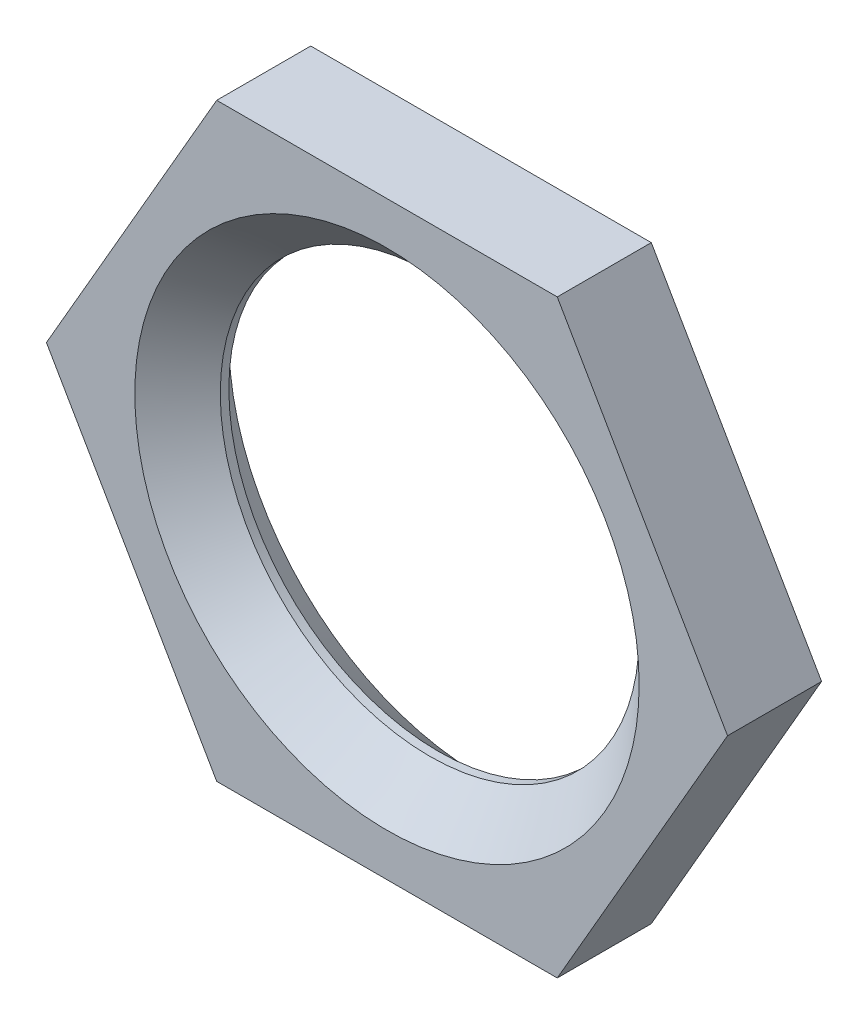
ISO-10303-21;
HEADER;
FILE_DESCRIPTION(('STEP AP214'),'2;1');
FILE_NAME('part.step','',(''),(''),'','','');
FILE_SCHEMA(('AUTOMOTIVE_DESIGN { 1 0 10303 214 1 1 1 1 }'));
ENDSEC;
DATA;
#1=APPLICATION_CONTEXT('core data for automotive mechanical design processes');
#2=APPLICATION_PROTOCOL_DEFINITION('international standard','automotive_design',2000,#1);
#3=PRODUCT_CONTEXT('',#1,'mechanical');
#4=PRODUCT('Part','Part','',(#3));
#5=PRODUCT_RELATED_PRODUCT_CATEGORY('part','',(#4));
#6=PRODUCT_DEFINITION_FORMATION('','',#4);
#7=PRODUCT_DEFINITION_CONTEXT('part definition',#1,'design');
#8=PRODUCT_DEFINITION('design','',#6,#7);
#9=PRODUCT_DEFINITION_SHAPE('','',#8);
#10=(LENGTH_UNIT() NAMED_UNIT(*) SI_UNIT(.MILLI.,.METRE.));
#11=(NAMED_UNIT(*) PLANE_ANGLE_UNIT() SI_UNIT($,.RADIAN.));
#12=(NAMED_UNIT(*) SI_UNIT($,.STERADIAN.) SOLID_ANGLE_UNIT());
#13=UNCERTAINTY_MEASURE_WITH_UNIT(LENGTH_MEASURE(1.E-05),#10,'distance_accuracy_value','');
#14=(GEOMETRIC_REPRESENTATION_CONTEXT(3) GLOBAL_UNCERTAINTY_ASSIGNED_CONTEXT((#13)) GLOBAL_UNIT_ASSIGNED_CONTEXT((#10,
#11,#12)) REPRESENTATION_CONTEXT('',''));
#15=CARTESIAN_POINT('',(0.,0.,0.));
#16=DIRECTION('',(0.,0.,1.));
#17=DIRECTION('',(1.,0.,0.));
#18=AXIS2_PLACEMENT_3D('',#15,#16,#17);
#19=CARTESIAN_POINT('',(0.,0.,2.2));
#20=DIRECTION('',(0.,0.,1.));
#21=DIRECTION('',(1.,0.,0.));
#22=AXIS2_PLACEMENT_3D('',#19,#20,#21);
#23=PLANE('',#22);
#24=CARTESIAN_POINT('',(0.,0.,2.2));
#25=DIRECTION('',(0.,0.,1.));
#26=DIRECTION('',(1.,0.,0.));
#27=AXIS2_PLACEMENT_3D('',#24,#25,#26);
#28=CIRCLE('',#27,5.90000000000001);
#29=CARTESIAN_POINT('',(5.90000000000001,0.,2.2));
#30=VERTEX_POINT('',#29);
#31=EDGE_CURVE('E11',#30,#30,#28,.F.);
#32=ORIENTED_EDGE('',*,*,#31,.T.);
#33=EDGE_LOOP('',(#32));
#34=FACE_BOUND('',#33,.T.);
#35=DIRECTION('',(-0.5,0.866025403784439,0.));
#36=VECTOR('',#35,1.);
#37=CARTESIAN_POINT('',(7.96743371481684,0.,2.2));
#38=LINE('',#37,#36);
#39=CARTESIAN_POINT('',(7.96743371481684,0.,2.2));
#40=VERTEX_POINT('',#39);
#41=CARTESIAN_POINT('',(3.98371685740842,6.9,2.2));
#42=VERTEX_POINT('',#41);
#43=EDGE_CURVE('E148',#40,#42,#38,.T.);
#44=ORIENTED_EDGE('',*,*,#43,.T.);
#45=DIRECTION('',(-1.,0.,0.));
#46=VECTOR('',#45,1.);
#47=CARTESIAN_POINT('',(3.98371685740842,6.9,2.2));
#48=LINE('',#47,#46);
#49=CARTESIAN_POINT('',(-3.98371685740842,6.9,2.2));
#50=VERTEX_POINT('',#49);
#51=EDGE_CURVE('E98',#42,#50,#48,.T.);
#52=ORIENTED_EDGE('',*,*,#51,.T.);
#53=DIRECTION('',(-0.5,-0.866025403784439,0.));
#54=VECTOR('',#53,1.);
#55=CARTESIAN_POINT('',(-3.98371685740842,6.9,2.2));
#56=LINE('',#55,#54);
#57=CARTESIAN_POINT('',(-7.96743371481684,0.,2.2));
#58=VERTEX_POINT('',#57);
#59=EDGE_CURVE('E110',#50,#58,#56,.T.);
#60=ORIENTED_EDGE('',*,*,#59,.T.);
#61=DIRECTION('',(0.5,-0.866025403784438,0.));
#62=VECTOR('',#61,1.);
#63=CARTESIAN_POINT('',(-7.96743371481684,0.,2.2));
#64=LINE('',#63,#62);
#65=CARTESIAN_POINT('',(-3.98371685740841,-6.9,2.2));
#66=VERTEX_POINT('',#65);
#67=EDGE_CURVE('E105',#58,#66,#64,.T.);
#68=ORIENTED_EDGE('',*,*,#67,.T.);
#69=DIRECTION('',(1.,0.,0.));
#70=VECTOR('',#69,1.);
#71=CARTESIAN_POINT('',(-3.98371685740841,-6.9,2.2));
#72=LINE('',#71,#70);
#73=CARTESIAN_POINT('',(3.98371685740842,-6.9,2.2));
#74=VERTEX_POINT('',#73);
#75=EDGE_CURVE('E108',#66,#74,#72,.T.);
#76=ORIENTED_EDGE('',*,*,#75,.T.);
#77=DIRECTION('',(0.5,0.866025403784439,0.));
#78=VECTOR('',#77,1.);
#79=CARTESIAN_POINT('',(3.98371685740842,-6.9,2.2));
#80=LINE('',#79,#78);
#81=EDGE_CURVE('E60',#74,#40,#80,.T.);
#82=ORIENTED_EDGE('',*,*,#81,.T.);
#83=EDGE_LOOP('',(#44,#52,#60,#68,#76,#82));
#84=FACE_BOUND('',#83,.T.);
#85=ADVANCED_FACE('F41',(#34,#84),#23,.T.);
#86=CARTESIAN_POINT('',(0.,0.,0.));
#87=DIRECTION('',(0.,0.,1.));
#88=DIRECTION('',(1.,0.,0.));
#89=AXIS2_PLACEMENT_3D('',#86,#87,#88);
#90=PLANE('',#89);
#91=CARTESIAN_POINT('',(0.,0.,0.));
#92=DIRECTION('',(0.,0.,1.));
#93=DIRECTION('',(1.,0.,0.));
#94=AXIS2_PLACEMENT_3D('',#91,#92,#93);
#95=CIRCLE('',#94,5.9);
#96=CARTESIAN_POINT('',(5.9,0.,0.));
#97=VERTEX_POINT('',#96);
#98=EDGE_CURVE('E162',#97,#97,#95,.T.);
#99=ORIENTED_EDGE('',*,*,#98,.T.);
#100=EDGE_LOOP('',(#99));
#101=FACE_BOUND('',#100,.T.);
#102=DIRECTION('',(-0.5,0.866025403784439,0.));
#103=VECTOR('',#102,1.);
#104=CARTESIAN_POINT('',(7.96743371481684,0.,0.));
#105=LINE('',#104,#103);
#106=CARTESIAN_POINT('',(7.96743371481684,0.,0.));
#107=VERTEX_POINT('',#106);
#108=CARTESIAN_POINT('',(3.98371685740842,6.9,0.));
#109=VERTEX_POINT('',#108);
#110=EDGE_CURVE('E132',#107,#109,#105,.T.);
#111=ORIENTED_EDGE('',*,*,#110,.F.);
#112=DIRECTION('',(0.5,0.866025403784439,0.));
#113=VECTOR('',#112,1.);
#114=CARTESIAN_POINT('',(3.98371685740842,-6.9,0.));
#115=LINE('',#114,#113);
#116=CARTESIAN_POINT('',(3.98371685740842,-6.9,0.));
#117=VERTEX_POINT('',#116);
#118=EDGE_CURVE('E89',#117,#107,#115,.T.);
#119=ORIENTED_EDGE('',*,*,#118,.F.);
#120=DIRECTION('',(1.,0.,0.));
#121=VECTOR('',#120,1.);
#122=CARTESIAN_POINT('',(-3.98371685740841,-6.9,0.));
#123=LINE('',#122,#121);
#124=CARTESIAN_POINT('',(-3.98371685740841,-6.9,0.));
#125=VERTEX_POINT('',#124);
#126=EDGE_CURVE('E83',#125,#117,#123,.T.);
#127=ORIENTED_EDGE('',*,*,#126,.F.);
#128=DIRECTION('',(0.5,-0.866025403784438,0.));
#129=VECTOR('',#128,1.);
#130=CARTESIAN_POINT('',(-7.96743371481684,0.,0.));
#131=LINE('',#130,#129);
#132=CARTESIAN_POINT('',(-7.96743371481684,0.,0.));
#133=VERTEX_POINT('',#132);
#134=EDGE_CURVE('E119',#133,#125,#131,.T.);
#135=ORIENTED_EDGE('',*,*,#134,.F.);
#136=DIRECTION('',(-0.5,-0.866025403784439,0.));
#137=VECTOR('',#136,1.);
#138=CARTESIAN_POINT('',(-3.98371685740842,6.9,0.));
#139=LINE('',#138,#137);
#140=CARTESIAN_POINT('',(-3.98371685740842,6.9,0.));
#141=VERTEX_POINT('',#140);
#142=EDGE_CURVE('E139',#141,#133,#139,.T.);
#143=ORIENTED_EDGE('',*,*,#142,.F.);
#144=DIRECTION('',(-1.,0.,0.));
#145=VECTOR('',#144,1.);
#146=CARTESIAN_POINT('',(3.98371685740842,6.9,0.));
#147=LINE('',#146,#145);
#148=EDGE_CURVE('E136',#109,#141,#147,.T.);
#149=ORIENTED_EDGE('',*,*,#148,.F.);
#150=EDGE_LOOP('',(#111,#119,#127,#135,#143,#149));
#151=FACE_BOUND('',#150,.T.);
#152=ADVANCED_FACE('F181',(#101,#151),#90,.F.);
#153=CARTESIAN_POINT('',(7.96743371481684,0.,2.2));
#154=DIRECTION('',(-0.866025403784439,-0.5,0.));
#155=DIRECTION('',(0.5,-0.866025403784439,0.));
#156=AXIS2_PLACEMENT_3D('',#153,#154,#155);
#157=PLANE('',#156);
#158=ORIENTED_EDGE('',*,*,#110,.T.);
#159=DIRECTION('',(0.,0.,-1.));
#160=VECTOR('',#159,1.);
#161=CARTESIAN_POINT('',(3.98371685740842,6.9,2.2));
#162=LINE('',#161,#160);
#163=EDGE_CURVE('E159',#42,#109,#162,.T.);
#164=ORIENTED_EDGE('',*,*,#163,.F.);
#165=ORIENTED_EDGE('',*,*,#43,.F.);
#166=DIRECTION('',(0.,0.,-1.));
#167=VECTOR('',#166,1.);
#168=CARTESIAN_POINT('',(7.96743371481684,0.,2.2));
#169=LINE('',#168,#167);
#170=EDGE_CURVE('E128',#40,#107,#169,.T.);
#171=ORIENTED_EDGE('',*,*,#170,.T.);
#172=EDGE_LOOP('',(#158,#164,#165,#171));
#173=FACE_BOUND('',#172,.T.);
#174=ADVANCED_FACE('F184',(#173),#157,.F.);
#175=CARTESIAN_POINT('',(3.98371685740842,6.9,2.2));
#176=DIRECTION('',(0.,-1.,0.));
#177=DIRECTION('',(0.,0.,-1.));
#178=AXIS2_PLACEMENT_3D('',#175,#176,#177);
#179=PLANE('',#178);
#180=ORIENTED_EDGE('',*,*,#148,.T.);
#181=DIRECTION('',(0.,0.,-1.));
#182=VECTOR('',#181,1.);
#183=CARTESIAN_POINT('',(-3.98371685740842,6.9,2.2));
#184=LINE('',#183,#182);
#185=EDGE_CURVE('E155',#50,#141,#184,.T.);
#186=ORIENTED_EDGE('',*,*,#185,.F.);
#187=ORIENTED_EDGE('',*,*,#51,.F.);
#188=ORIENTED_EDGE('',*,*,#163,.T.);
#189=EDGE_LOOP('',(#180,#186,#187,#188));
#190=FACE_BOUND('',#189,.T.);
#191=ADVANCED_FACE('F260',(#190),#179,.F.);
#192=CARTESIAN_POINT('',(-3.98371685740842,6.9,2.2));
#193=DIRECTION('',(0.866025403784439,-0.5,0.));
#194=DIRECTION('',(0.5,0.866025403784439,0.));
#195=AXIS2_PLACEMENT_3D('',#192,#193,#194);
#196=PLANE('',#195);
#197=ORIENTED_EDGE('',*,*,#142,.T.);
#198=DIRECTION('',(0.,0.,-1.));
#199=VECTOR('',#198,1.);
#200=CARTESIAN_POINT('',(-7.96743371481684,0.,2.2));
#201=LINE('',#200,#199);
#202=EDGE_CURVE('E121',#58,#133,#201,.T.);
#203=ORIENTED_EDGE('',*,*,#202,.F.);
#204=ORIENTED_EDGE('',*,*,#59,.F.);
#205=ORIENTED_EDGE('',*,*,#185,.T.);
#206=EDGE_LOOP('',(#197,#203,#204,#205));
#207=FACE_BOUND('',#206,.T.);
#208=ADVANCED_FACE('F251',(#207),#196,.F.);
#209=CARTESIAN_POINT('',(-7.96743371481684,0.,2.2));
#210=DIRECTION('',(0.866025403784438,0.5,0.));
#211=DIRECTION('',(-0.5,0.866025403784439,0.));
#212=AXIS2_PLACEMENT_3D('',#209,#210,#211);
#213=PLANE('',#212);
#214=ORIENTED_EDGE('',*,*,#134,.T.);
#215=DIRECTION('',(0.,0.,-1.));
#216=VECTOR('',#215,1.);
#217=CARTESIAN_POINT('',(-3.98371685740841,-6.9,2.2));
#218=LINE('',#217,#216);
#219=EDGE_CURVE('E116',#66,#125,#218,.T.);
#220=ORIENTED_EDGE('',*,*,#219,.F.);
#221=ORIENTED_EDGE('',*,*,#67,.F.);
#222=ORIENTED_EDGE('',*,*,#202,.T.);
#223=EDGE_LOOP('',(#214,#220,#221,#222));
#224=FACE_BOUND('',#223,.T.);
#225=ADVANCED_FACE('F117',(#224),#213,.F.);
#226=CARTESIAN_POINT('',(-3.98371685740841,-6.9,2.2));
#227=DIRECTION('',(0.,1.,0.));
#228=DIRECTION('',(-1.,0.,0.));
#229=AXIS2_PLACEMENT_3D('',#226,#227,#228);
#230=PLANE('',#229);
#231=ORIENTED_EDGE('',*,*,#126,.T.);
#232=DIRECTION('',(0.,0.,-1.));
#233=VECTOR('',#232,1.);
#234=CARTESIAN_POINT('',(3.98371685740842,-6.9,2.2));
#235=LINE('',#234,#233);
#236=EDGE_CURVE('E122',#74,#117,#235,.T.);
#237=ORIENTED_EDGE('',*,*,#236,.F.);
#238=ORIENTED_EDGE('',*,*,#75,.F.);
#239=ORIENTED_EDGE('',*,*,#219,.T.);
#240=EDGE_LOOP('',(#231,#237,#238,#239));
#241=FACE_BOUND('',#240,.T.);
#242=ADVANCED_FACE('F124',(#241),#230,.F.);
#243=CARTESIAN_POINT('',(3.98371685740842,-6.9,2.2));
#244=DIRECTION('',(-0.866025403784439,0.5,0.));
#245=DIRECTION('',(-0.5,-0.866025403784439,0.));
#246=AXIS2_PLACEMENT_3D('',#243,#244,#245);
#247=PLANE('',#246);
#248=ORIENTED_EDGE('',*,*,#118,.T.);
#249=ORIENTED_EDGE('',*,*,#170,.F.);
#250=ORIENTED_EDGE('',*,*,#81,.F.);
#251=ORIENTED_EDGE('',*,*,#236,.T.);
#252=EDGE_LOOP('',(#248,#249,#250,#251));
#253=FACE_BOUND('',#252,.T.);
#254=ADVANCED_FACE('F191',(#253),#247,.F.);
#255=CARTESIAN_POINT('',(0.,0.,2.2));
#256=DIRECTION('',(0.,0.,-1.));
#257=DIRECTION('',(-1.,0.,0.));
#258=AXIS2_PLACEMENT_3D('',#255,#256,#257);
#259=CYLINDRICAL_SURFACE('',#258,4.9);
#260=CARTESIAN_POINT('',(0.,0.,1.00000000000001));
#261=DIRECTION('',(0.,0.,1.));
#262=DIRECTION('',(1.,0.,0.));
#263=AXIS2_PLACEMENT_3D('',#260,#261,#262);
#264=CIRCLE('',#263,4.9);
#265=CARTESIAN_POINT('',(4.9,0.,1.00000000000001));
#266=VERTEX_POINT('',#265);
#267=EDGE_CURVE('E52',#266,#266,#264,.F.);
#268=ORIENTED_EDGE('',*,*,#267,.T.);
#269=EDGE_LOOP('',(#268));
#270=FACE_BOUND('',#269,.T.);
#271=CARTESIAN_POINT('',(0.,0.,1.2));
#272=DIRECTION('',(0.,0.,1.));
#273=DIRECTION('',(1.,0.,0.));
#274=AXIS2_PLACEMENT_3D('',#271,#272,#273);
#275=CIRCLE('',#274,4.9);
#276=CARTESIAN_POINT('',(4.9,0.,1.2));
#277=VERTEX_POINT('',#276);
#278=EDGE_CURVE('E166',#277,#277,#275,.T.);
#279=ORIENTED_EDGE('',*,*,#278,.T.);
#280=EDGE_LOOP('',(#279));
#281=FACE_BOUND('',#280,.T.);
#282=ADVANCED_FACE('F173',(#270,#281),#259,.F.);
#283=CARTESIAN_POINT('',(0.,0.,0.));
#284=DIRECTION('',(0.,0.,-1.));
#285=DIRECTION('',(-1.,0.,0.));
#286=AXIS2_PLACEMENT_3D('',#283,#284,#285);
#287=CONICAL_SURFACE('',#286,5.9,0.785398163397447);
#288=ORIENTED_EDGE('',*,*,#267,.F.);
#289=EDGE_LOOP('',(#288));
#290=FACE_BOUND('',#289,.T.);
#291=ORIENTED_EDGE('',*,*,#98,.F.);
#292=EDGE_LOOP('',(#291));
#293=FACE_BOUND('',#292,.T.);
#294=ADVANCED_FACE('F176',(#290,#293),#287,.F.);
#295=CARTESIAN_POINT('',(0.,0.,1.2));
#296=DIRECTION('',(0.,0.,1.));
#297=DIRECTION('',(1.,0.,0.));
#298=AXIS2_PLACEMENT_3D('',#295,#296,#297);
#299=CONICAL_SURFACE('',#298,4.9,0.78539816339745);
#300=ORIENTED_EDGE('',*,*,#31,.F.);
#301=EDGE_LOOP('',(#300));
#302=FACE_BOUND('',#301,.T.);
#303=ORIENTED_EDGE('',*,*,#278,.F.);
#304=EDGE_LOOP('',(#303));
#305=FACE_BOUND('',#304,.T.);
#306=ADVANCED_FACE('F44',(#302,#305),#299,.F.);
#307=CLOSED_SHELL('',(#85,#152,#174,#191,#208,#225,#242,#254,#282,#294,#306));
#308=MANIFOLD_SOLID_BREP('B2',#307);
#309=ADVANCED_BREP_SHAPE_REPRESENTATION('',(#18,#308),#14);
#310=SHAPE_DEFINITION_REPRESENTATION(#9,#309);
ENDSEC;
END-ISO-10303-21;
